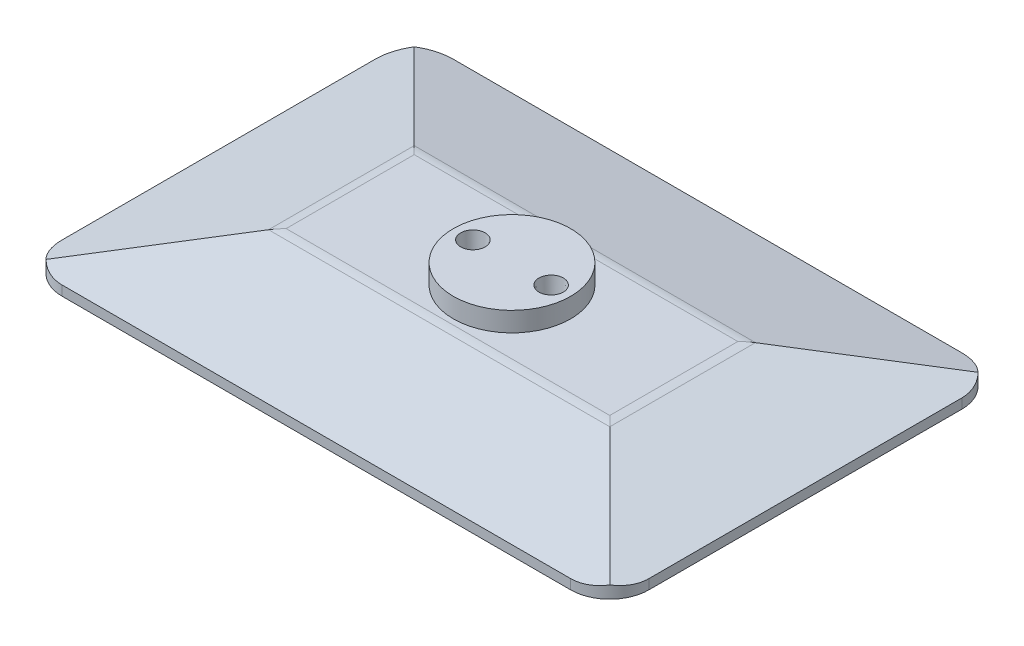
ISO-10303-21;
HEADER;
FILE_DESCRIPTION(('STEP AP214'),'2;1');
FILE_NAME('part.step','',(''),(''),'','','');
FILE_SCHEMA(('AUTOMOTIVE_DESIGN { 1 0 10303 214 1 1 1 1 }'));
ENDSEC;
DATA;
#1=APPLICATION_CONTEXT('core data for automotive mechanical design processes');
#2=APPLICATION_PROTOCOL_DEFINITION('international standard','automotive_design',2000,#1);
#3=PRODUCT_CONTEXT('',#1,'mechanical');
#4=PRODUCT('Part','Part','',(#3));
#5=PRODUCT_RELATED_PRODUCT_CATEGORY('part','',(#4));
#6=PRODUCT_DEFINITION_FORMATION('','',#4);
#7=PRODUCT_DEFINITION_CONTEXT('part definition',#1,'design');
#8=PRODUCT_DEFINITION('design','',#6,#7);
#9=PRODUCT_DEFINITION_SHAPE('','',#8);
#10=(LENGTH_UNIT() NAMED_UNIT(*) SI_UNIT(.MILLI.,.METRE.));
#11=(NAMED_UNIT(*) PLANE_ANGLE_UNIT() SI_UNIT($,.RADIAN.));
#12=(NAMED_UNIT(*) SI_UNIT($,.STERADIAN.) SOLID_ANGLE_UNIT());
#13=UNCERTAINTY_MEASURE_WITH_UNIT(LENGTH_MEASURE(1.E-05),#10,'distance_accuracy_value','');
#14=(GEOMETRIC_REPRESENTATION_CONTEXT(3) GLOBAL_UNCERTAINTY_ASSIGNED_CONTEXT((#13)) GLOBAL_UNIT_ASSIGNED_CONTEXT((#10,
#11,#12)) REPRESENTATION_CONTEXT('',''));
#15=CARTESIAN_POINT('',(0.,0.,0.));
#16=DIRECTION('',(0.,0.,1.));
#17=DIRECTION('',(1.,0.,0.));
#18=AXIS2_PLACEMENT_3D('',#15,#16,#17);
#19=CARTESIAN_POINT('',(35.9753753515998,1.,-9.78625051835227));
#20=DIRECTION('',(-1.,0.,0.));
#21=DIRECTION('',(0.,0.,1.));
#22=AXIS2_PLACEMENT_3D('',#19,#20,#21);
#23=PLANE('',#22);
#24=DIRECTION('',(0.,0.,-1.));
#25=VECTOR('',#24,1.);
#26=CARTESIAN_POINT('',(35.9753753515998,0.,-9.78625051835227));
#27=LINE('',#26,#25);
#28=CARTESIAN_POINT('',(35.9753753515998,0.,26.2137494816477));
#29=VERTEX_POINT('',#28);
#30=CARTESIAN_POINT('',(35.9753753515998,0.,-5.78625051835227));
#31=VERTEX_POINT('',#30);
#32=EDGE_CURVE('E173',#29,#31,#27,.T.);
#33=ORIENTED_EDGE('',*,*,#32,.T.);
#34=DIRECTION('',(0.,-1.,0.));
#35=VECTOR('',#34,1.);
#36=CARTESIAN_POINT('',(35.9753753515998,1.,-5.78625051835227));
#37=LINE('',#36,#35);
#38=CARTESIAN_POINT('',(35.9753753515998,1.,-5.78625051835227));
#39=VERTEX_POINT('',#38);
#40=EDGE_CURVE('E199',#31,#39,#37,.F.);
#41=ORIENTED_EDGE('',*,*,#40,.T.);
#42=DIRECTION('',(0.,0.,-1.));
#43=VECTOR('',#42,1.);
#44=CARTESIAN_POINT('',(35.9753753515998,1.,-9.78625051835227));
#45=LINE('',#44,#43);
#46=CARTESIAN_POINT('',(35.9753753515998,1.,26.2137494816477));
#47=VERTEX_POINT('',#46);
#48=EDGE_CURVE('E171',#47,#39,#45,.T.);
#49=ORIENTED_EDGE('',*,*,#48,.F.);
#50=DIRECTION('',(0.,-1.,0.));
#51=VECTOR('',#50,1.);
#52=CARTESIAN_POINT('',(35.9753753515998,1.,26.2137494816477));
#53=LINE('',#52,#51);
#54=EDGE_CURVE('E196',#47,#29,#53,.T.);
#55=ORIENTED_EDGE('',*,*,#54,.T.);
#56=EDGE_LOOP('',(#33,#41,#49,#55));
#57=FACE_BOUND('',#56,.T.);
#58=ADVANCED_FACE('F39',(#57),#23,.F.);
#59=CARTESIAN_POINT('',(-24.0246246484002,1.,-9.78625051835227));
#60=DIRECTION('',(0.,0.,1.));
#61=DIRECTION('',(1.,0.,0.));
#62=AXIS2_PLACEMENT_3D('',#59,#60,#61);
#63=PLANE('',#62);
#64=DIRECTION('',(-1.,0.,0.));
#65=VECTOR('',#64,1.);
#66=CARTESIAN_POINT('',(-24.0246246484002,0.,-9.78625051835227));
#67=LINE('',#66,#65);
#68=CARTESIAN_POINT('',(31.9753753515998,0.,-9.78625051835227));
#69=VERTEX_POINT('',#68);
#70=CARTESIAN_POINT('',(-20.0246246484002,0.,-9.78625051835227));
#71=VERTEX_POINT('',#70);
#72=EDGE_CURVE('E168',#69,#71,#67,.T.);
#73=ORIENTED_EDGE('',*,*,#72,.T.);
#74=DIRECTION('',(0.,-1.,0.));
#75=VECTOR('',#74,1.);
#76=CARTESIAN_POINT('',(-20.0246246484002,1.,-9.78625051835227));
#77=LINE('',#76,#75);
#78=CARTESIAN_POINT('',(-20.0246246484002,1.,-9.78625051835227));
#79=VERTEX_POINT('',#78);
#80=EDGE_CURVE('E146',#71,#79,#77,.F.);
#81=ORIENTED_EDGE('',*,*,#80,.T.);
#82=DIRECTION('',(-1.,0.,0.));
#83=VECTOR('',#82,1.);
#84=CARTESIAN_POINT('',(-24.0246246484002,1.,-9.78625051835227));
#85=LINE('',#84,#83);
#86=CARTESIAN_POINT('',(31.9753753515998,1.,-9.78625051835227));
#87=VERTEX_POINT('',#86);
#88=EDGE_CURVE('E267',#87,#79,#85,.T.);
#89=ORIENTED_EDGE('',*,*,#88,.F.);
#90=DIRECTION('',(0.,-1.,0.));
#91=VECTOR('',#90,1.);
#92=CARTESIAN_POINT('',(31.9753753515998,1.,-9.78625051835227));
#93=LINE('',#92,#91);
#94=EDGE_CURVE('E151',#87,#69,#93,.T.);
#95=ORIENTED_EDGE('',*,*,#94,.T.);
#96=EDGE_LOOP('',(#73,#81,#89,#95));
#97=FACE_BOUND('',#96,.T.);
#98=ADVANCED_FACE('F305',(#97),#63,.F.);
#99=CARTESIAN_POINT('',(-24.0246246484002,1.,-9.78625051835227));
#100=DIRECTION('',(1.,0.,0.));
#101=DIRECTION('',(0.,0.,-1.));
#102=AXIS2_PLACEMENT_3D('',#99,#100,#101);
#103=PLANE('',#102);
#104=DIRECTION('',(0.,0.,1.));
#105=VECTOR('',#104,1.);
#106=CARTESIAN_POINT('',(-24.0246246484002,1.,-9.78625051835227));
#107=LINE('',#106,#105);
#108=CARTESIAN_POINT('',(-24.0246246484002,1.,-5.78625051835227));
#109=VERTEX_POINT('',#108);
#110=CARTESIAN_POINT('',(-24.0246246484002,1.,26.2137494816477));
#111=VERTEX_POINT('',#110);
#112=EDGE_CURVE('E161',#109,#111,#107,.T.);
#113=ORIENTED_EDGE('',*,*,#112,.F.);
#114=DIRECTION('',(0.,-1.,0.));
#115=VECTOR('',#114,1.);
#116=CARTESIAN_POINT('',(-24.0246246484002,1.,-5.78625051835227));
#117=LINE('',#116,#115);
#118=CARTESIAN_POINT('',(-24.0246246484002,0.,-5.78625051835227));
#119=VERTEX_POINT('',#118);
#120=EDGE_CURVE('E145',#109,#119,#117,.T.);
#121=ORIENTED_EDGE('',*,*,#120,.T.);
#122=DIRECTION('',(0.,0.,1.));
#123=VECTOR('',#122,1.);
#124=CARTESIAN_POINT('',(-24.0246246484002,0.,-9.78625051835227));
#125=LINE('',#124,#123);
#126=CARTESIAN_POINT('',(-24.0246246484002,0.,26.2137494816477));
#127=VERTEX_POINT('',#126);
#128=EDGE_CURVE('E158',#119,#127,#125,.T.);
#129=ORIENTED_EDGE('',*,*,#128,.T.);
#130=DIRECTION('',(0.,-1.,0.));
#131=VECTOR('',#130,1.);
#132=CARTESIAN_POINT('',(-24.0246246484002,1.,26.2137494816477));
#133=LINE('',#132,#131);
#134=EDGE_CURVE('E163',#127,#111,#133,.F.);
#135=ORIENTED_EDGE('',*,*,#134,.T.);
#136=EDGE_LOOP('',(#113,#121,#129,#135));
#137=FACE_BOUND('',#136,.T.);
#138=ADVANCED_FACE('F157',(#137),#103,.F.);
#139=CARTESIAN_POINT('',(-24.0246246484002,1.,30.2137494816477));
#140=DIRECTION('',(0.,0.,-1.));
#141=DIRECTION('',(-1.,0.,0.));
#142=AXIS2_PLACEMENT_3D('',#139,#140,#141);
#143=PLANE('',#142);
#144=DIRECTION('',(1.,0.,0.));
#145=VECTOR('',#144,1.);
#146=CARTESIAN_POINT('',(-24.0246246484002,0.,30.2137494816477));
#147=LINE('',#146,#145);
#148=CARTESIAN_POINT('',(-20.0246246484002,0.,30.2137494816477));
#149=VERTEX_POINT('',#148);
#150=CARTESIAN_POINT('',(31.9753753515998,0.,30.2137494816477));
#151=VERTEX_POINT('',#150);
#152=EDGE_CURVE('E167',#149,#151,#147,.T.);
#153=ORIENTED_EDGE('',*,*,#152,.T.);
#154=DIRECTION('',(0.,-1.,0.));
#155=VECTOR('',#154,1.);
#156=CARTESIAN_POINT('',(31.9753753515998,1.,30.2137494816477));
#157=LINE('',#156,#155);
#158=CARTESIAN_POINT('',(31.9753753515998,1.,30.2137494816477));
#159=VERTEX_POINT('',#158);
#160=EDGE_CURVE('E209',#151,#159,#157,.F.);
#161=ORIENTED_EDGE('',*,*,#160,.T.);
#162=DIRECTION('',(1.,0.,0.));
#163=VECTOR('',#162,1.);
#164=CARTESIAN_POINT('',(-24.0246246484002,1.,30.2137494816477));
#165=LINE('',#164,#163);
#166=CARTESIAN_POINT('',(-20.0246246484002,1.,30.2137494816477));
#167=VERTEX_POINT('',#166);
#168=EDGE_CURVE('E177',#167,#159,#165,.T.);
#169=ORIENTED_EDGE('',*,*,#168,.F.);
#170=DIRECTION('',(0.,-1.,0.));
#171=VECTOR('',#170,1.);
#172=CARTESIAN_POINT('',(-20.0246246484002,1.,30.2137494816477));
#173=LINE('',#172,#171);
#174=EDGE_CURVE('E206',#167,#149,#173,.T.);
#175=ORIENTED_EDGE('',*,*,#174,.T.);
#176=EDGE_LOOP('',(#153,#161,#169,#175));
#177=FACE_BOUND('',#176,.T.);
#178=ADVANCED_FACE('F293',(#177),#143,.F.);
#179=CARTESIAN_POINT('',(0.,0.,0.));
#180=DIRECTION('',(0.,1.,0.));
#181=DIRECTION('',(0.,0.,1.));
#182=AXIS2_PLACEMENT_3D('',#179,#180,#181);
#183=PLANE('',#182);
#184=ORIENTED_EDGE('',*,*,#128,.F.);
#185=CARTESIAN_POINT('',(-20.0246246484002,0.,-5.78625051835227));
#186=DIRECTION('',(0.,1.,0.));
#187=DIRECTION('',(0.,0.,1.));
#188=AXIS2_PLACEMENT_3D('',#185,#186,#187);
#189=CIRCLE('',#188,4.);
#190=EDGE_CURVE('E140',#119,#71,#189,.F.);
#191=ORIENTED_EDGE('',*,*,#190,.T.);
#192=ORIENTED_EDGE('',*,*,#72,.F.);
#193=CARTESIAN_POINT('',(31.9753753515998,0.,-5.78625051835227));
#194=DIRECTION('',(0.,1.,0.));
#195=DIRECTION('',(0.,0.,1.));
#196=AXIS2_PLACEMENT_3D('',#193,#194,#195);
#197=CIRCLE('',#196,4.);
#198=EDGE_CURVE('E152',#69,#31,#197,.F.);
#199=ORIENTED_EDGE('',*,*,#198,.T.);
#200=ORIENTED_EDGE('',*,*,#32,.F.);
#201=CARTESIAN_POINT('',(31.9753753515998,0.,26.2137494816477));
#202=DIRECTION('',(0.,1.,0.));
#203=DIRECTION('',(0.,0.,1.));
#204=AXIS2_PLACEMENT_3D('',#201,#202,#203);
#205=CIRCLE('',#204,4.);
#206=EDGE_CURVE('E180',#29,#151,#205,.F.);
#207=ORIENTED_EDGE('',*,*,#206,.T.);
#208=ORIENTED_EDGE('',*,*,#152,.F.);
#209=CARTESIAN_POINT('',(-20.0246246484002,0.,26.2137494816477));
#210=DIRECTION('',(0.,1.,0.));
#211=DIRECTION('',(0.,0.,1.));
#212=AXIS2_PLACEMENT_3D('',#209,#210,#211);
#213=CIRCLE('',#212,4.);
#214=EDGE_CURVE('E162',#149,#127,#213,.F.);
#215=ORIENTED_EDGE('',*,*,#214,.T.);
#216=EDGE_LOOP('',(#184,#191,#192,#199,#200,#207,#208,#215));
#217=FACE_BOUND('',#216,.T.);
#218=ADVANCED_FACE('F165',(#217),#183,.F.);
#219=CARTESIAN_POINT('',(-24.0246246484002,1.,30.2137494816477));
#220=DIRECTION('',(0.,0.974370064785236,0.224951054343863));
#221=DIRECTION('',(0.,-0.224951054343863,0.974370064785236));
#222=AXIS2_PLACEMENT_3D('',#219,#220,#221);
#223=PLANE('',#222);
#224=DIRECTION('',(0.697868801664496,-0.161115707883246,0.697868801664496));
#225=VECTOR('',#224,1.);
#226=CARTESIAN_POINT('',(35.9753753515998,1.,30.2137494816477));
#227=LINE('',#226,#225);
#228=CARTESIAN_POINT('',(23.4250095129161,3.89748025914094,17.663383642964));
#229=VERTEX_POINT('',#228);
#230=CARTESIAN_POINT('',(34.803802476346,1.27047891048162,29.0421766063939));
#231=VERTEX_POINT('',#230);
#232=EDGE_CURVE('E260',#229,#231,#227,.T.);
#233=ORIENTED_EDGE('',*,*,#232,.F.);
#234=DIRECTION('',(1.,0.,0.));
#235=VECTOR('',#234,1.);
#236=CARTESIAN_POINT('',(-11.0301970255476,3.89748025914094,17.663383642964));
#237=LINE('',#236,#235);
#238=CARTESIAN_POINT('',(-11.4742588097165,3.89748025914094,17.663383642964));
#239=VERTEX_POINT('',#238);
#240=EDGE_CURVE('E11',#229,#239,#237,.F.);
#241=ORIENTED_EDGE('',*,*,#240,.T.);
#242=DIRECTION('',(-0.697868801664496,-0.161115707883246,0.697868801664496));
#243=VECTOR('',#242,1.);
#244=CARTESIAN_POINT('',(-24.0246246484002,1.,30.2137494816477));
#245=LINE('',#244,#243);
#246=CARTESIAN_POINT('',(-22.8530517731464,1.27047891048162,29.0421766063939));
#247=VERTEX_POINT('',#246);
#248=EDGE_CURVE('E248',#239,#247,#245,.T.);
#249=ORIENTED_EDGE('',*,*,#248,.T.);
#250=CARTESIAN_POINT('',(-20.0246246484002,1.92347276450225,26.2137494816477));
#251=DIRECTION('',(0.,0.974370064785236,0.224951054343863));
#252=DIRECTION('',(0.,-0.224951054343864,0.974370064785236));
#253=AXIS2_PLACEMENT_3D('',#250,#251,#252);
#254=ELLIPSE('',#253,4.10521643117356,4.);
#255=EDGE_CURVE('E211',#247,#167,#254,.T.);
#256=ORIENTED_EDGE('',*,*,#255,.T.);
#257=ORIENTED_EDGE('',*,*,#168,.T.);
#258=CARTESIAN_POINT('',(31.9753753515998,1.92347276450225,26.2137494816477));
#259=DIRECTION('',(0.,0.974370064785236,0.224951054343863));
#260=DIRECTION('',(0.,-0.224951054343864,0.974370064785236));
#261=AXIS2_PLACEMENT_3D('',#258,#259,#260);
#262=ELLIPSE('',#261,4.10521643117356,4.);
#263=EDGE_CURVE('E213',#159,#231,#262,.T.);
#264=ORIENTED_EDGE('',*,*,#263,.T.);
#265=EDGE_LOOP('',(#233,#241,#249,#256,#257,#264));
#266=FACE_BOUND('',#265,.T.);
#267=ADVANCED_FACE('F349',(#266),#223,.T.);
#268=CARTESIAN_POINT('',(35.9753753515998,1.,30.2137494816477));
#269=DIRECTION('',(0.224951054343863,0.974370064785236,0.));
#270=DIRECTION('',(-0.974370064785236,0.224951054343863,0.));
#271=AXIS2_PLACEMENT_3D('',#268,#269,#270);
#272=PLANE('',#271);
#273=DIRECTION('',(0.697868801664496,-0.161115707883246,-0.697868801664496));
#274=VECTOR('',#273,1.);
#275=CARTESIAN_POINT('',(35.9753753515998,1.,-9.78625051835227));
#276=LINE('',#275,#274);
#277=CARTESIAN_POINT('',(23.4250095129161,3.89748025914094,2.76411532033141));
#278=VERTEX_POINT('',#277);
#279=CARTESIAN_POINT('',(34.803802476346,1.27047891048162,-8.61467764309846));
#280=VERTEX_POINT('',#279);
#281=EDGE_CURVE('E261',#278,#280,#276,.T.);
#282=ORIENTED_EDGE('',*,*,#281,.F.);
#283=DIRECTION('',(0.,0.,-1.));
#284=VECTOR('',#283,1.);
#285=CARTESIAN_POINT('',(23.4250095129161,3.89748025914094,17.2193218587952));
#286=LINE('',#285,#284);
#287=EDGE_CURVE('E226',#278,#229,#286,.F.);
#288=ORIENTED_EDGE('',*,*,#287,.T.);
#289=ORIENTED_EDGE('',*,*,#232,.T.);
#290=CARTESIAN_POINT('',(31.9753753515998,1.92347276450224,26.2137494816477));
#291=DIRECTION('',(0.224951054343863,0.974370064785236,0.));
#292=DIRECTION('',(0.974370064785236,-0.224951054343864,0.));
#293=AXIS2_PLACEMENT_3D('',#290,#291,#292);
#294=ELLIPSE('',#293,4.10521643117356,4.);
#295=EDGE_CURVE('E201',#231,#47,#294,.T.);
#296=ORIENTED_EDGE('',*,*,#295,.T.);
#297=ORIENTED_EDGE('',*,*,#48,.T.);
#298=CARTESIAN_POINT('',(31.9753753515998,1.92347276450225,-5.78625051835227));
#299=DIRECTION('',(0.224951054343863,0.974370064785236,0.));
#300=DIRECTION('',(0.974370064785236,-0.224951054343864,0.));
#301=AXIS2_PLACEMENT_3D('',#298,#299,#300);
#302=ELLIPSE('',#301,4.10521643117356,4.);
#303=EDGE_CURVE('E203',#39,#280,#302,.T.);
#304=ORIENTED_EDGE('',*,*,#303,.T.);
#305=EDGE_LOOP('',(#282,#288,#289,#296,#297,#304));
#306=FACE_BOUND('',#305,.T.);
#307=ADVANCED_FACE('F285',(#306),#272,.T.);
#308=CARTESIAN_POINT('',(35.9753753515998,1.,-9.78625051835227));
#309=DIRECTION('',(0.,0.974370064785236,-0.224951054343863));
#310=DIRECTION('',(0.,0.224951054343863,0.974370064785236));
#311=AXIS2_PLACEMENT_3D('',#308,#309,#310);
#312=PLANE('',#311);
#313=DIRECTION('',(-0.697868801664496,-0.161115707883246,-0.697868801664496));
#314=VECTOR('',#313,1.);
#315=CARTESIAN_POINT('',(-24.0246246484002,1.,-9.78625051835227));
#316=LINE('',#315,#314);
#317=CARTESIAN_POINT('',(-11.4742588097165,3.89748025914094,2.76411532033141));
#318=VERTEX_POINT('',#317);
#319=CARTESIAN_POINT('',(-22.8530517731464,1.27047891048162,-8.61467764309846));
#320=VERTEX_POINT('',#319);
#321=EDGE_CURVE('E252',#318,#320,#316,.T.);
#322=ORIENTED_EDGE('',*,*,#321,.F.);
#323=DIRECTION('',(-1.,0.,0.));
#324=VECTOR('',#323,1.);
#325=CARTESIAN_POINT('',(22.9809477287473,3.89748025914094,2.76411532033141));
#326=LINE('',#325,#324);
#327=EDGE_CURVE('E229',#318,#278,#326,.F.);
#328=ORIENTED_EDGE('',*,*,#327,.T.);
#329=ORIENTED_EDGE('',*,*,#281,.T.);
#330=CARTESIAN_POINT('',(31.9753753515998,1.92347276450225,-5.78625051835227));
#331=DIRECTION('',(0.,0.974370064785236,-0.224951054343863));
#332=DIRECTION('',(0.,-0.224951054343864,-0.974370064785236));
#333=AXIS2_PLACEMENT_3D('',#330,#331,#332);
#334=ELLIPSE('',#333,4.10521643117356,4.);
#335=EDGE_CURVE('E186',#280,#87,#334,.T.);
#336=ORIENTED_EDGE('',*,*,#335,.T.);
#337=ORIENTED_EDGE('',*,*,#88,.T.);
#338=CARTESIAN_POINT('',(-20.0246246484002,1.92347276450225,-5.78625051835227));
#339=DIRECTION('',(0.,0.974370064785236,-0.224951054343863));
#340=DIRECTION('',(0.,-0.224951054343864,-0.974370064785236));
#341=AXIS2_PLACEMENT_3D('',#338,#339,#340);
#342=ELLIPSE('',#341,4.10521643117356,4.);
#343=EDGE_CURVE('E188',#79,#320,#342,.T.);
#344=ORIENTED_EDGE('',*,*,#343,.T.);
#345=EDGE_LOOP('',(#322,#328,#329,#336,#337,#344));
#346=FACE_BOUND('',#345,.T.);
#347=ADVANCED_FACE('F302',(#346),#312,.T.);
#348=CARTESIAN_POINT('',(-24.0246246484002,1.,-9.78625051835227));
#349=DIRECTION('',(-0.224951054343863,0.974370064785236,0.));
#350=DIRECTION('',(-0.974370064785236,-0.224951054343863,0.));
#351=AXIS2_PLACEMENT_3D('',#348,#349,#350);
#352=PLANE('',#351);
#353=ORIENTED_EDGE('',*,*,#248,.F.);
#354=DIRECTION('',(0.,0.,1.));
#355=VECTOR('',#354,1.);
#356=CARTESIAN_POINT('',(-11.4742588097165,3.89748025914094,3.20817710450029));
#357=LINE('',#356,#355);
#358=EDGE_CURVE('E48',#239,#318,#357,.F.);
#359=ORIENTED_EDGE('',*,*,#358,.T.);
#360=ORIENTED_EDGE('',*,*,#321,.T.);
#361=CARTESIAN_POINT('',(-20.0246246484002,1.92347276450225,-5.78625051835227));
#362=DIRECTION('',(-0.224951054343863,0.974370064785236,0.));
#363=DIRECTION('',(-0.974370064785236,-0.224951054343864,0.));
#364=AXIS2_PLACEMENT_3D('',#361,#362,#363);
#365=ELLIPSE('',#364,4.10521643117356,4.);
#366=EDGE_CURVE('E194',#320,#109,#365,.T.);
#367=ORIENTED_EDGE('',*,*,#366,.T.);
#368=ORIENTED_EDGE('',*,*,#112,.T.);
#369=CARTESIAN_POINT('',(-20.0246246484002,1.92347276450225,26.2137494816477));
#370=DIRECTION('',(-0.224951054343863,0.974370064785236,0.));
#371=DIRECTION('',(-0.974370064785236,-0.224951054343864,0.));
#372=AXIS2_PLACEMENT_3D('',#369,#370,#371);
#373=ELLIPSE('',#372,4.10521643117356,4.);
#374=EDGE_CURVE('E191',#111,#247,#373,.T.);
#375=ORIENTED_EDGE('',*,*,#374,.T.);
#376=EDGE_LOOP('',(#353,#359,#360,#367,#368,#375));
#377=FACE_BOUND('',#376,.T.);
#378=ADVANCED_FACE('F300',(#377),#352,.T.);
#379=CARTESIAN_POINT('',(0.,4.,0.));
#380=DIRECTION('',(0.,1.,0.));
#381=DIRECTION('',(0.,0.,1.));
#382=AXIS2_PLACEMENT_3D('',#379,#380,#381);
#383=PLANE('',#382);
#384=DIRECTION('',(-1.,0.,0.));
#385=VECTOR('',#384,1.);
#386=CARTESIAN_POINT('',(22.9809477287473,4.,16.7635794255886));
#387=LINE('',#386,#385);
#388=CARTESIAN_POINT('',(-10.574454592341,4.,16.7635794255886));
#389=VERTEX_POINT('',#388);
#390=CARTESIAN_POINT('',(22.5252052955407,4.,16.7635794255886));
#391=VERTEX_POINT('',#390);
#392=EDGE_CURVE('E217',#389,#391,#387,.F.);
#393=ORIENTED_EDGE('',*,*,#392,.T.);
#394=DIRECTION('',(0.,0.,1.));
#395=VECTOR('',#394,1.);
#396=CARTESIAN_POINT('',(22.5252052955407,4.,3.20817710450029));
#397=LINE('',#396,#395);
#398=CARTESIAN_POINT('',(22.5252052955407,4.,3.66391953770687));
#399=VERTEX_POINT('',#398);
#400=EDGE_CURVE('E223',#391,#399,#397,.F.);
#401=ORIENTED_EDGE('',*,*,#400,.T.);
#402=DIRECTION('',(1.,0.,0.));
#403=VECTOR('',#402,1.);
#404=CARTESIAN_POINT('',(-11.0301970255476,4.,3.66391953770687));
#405=LINE('',#404,#403);
#406=CARTESIAN_POINT('',(-10.574454592341,4.,3.66391953770687));
#407=VERTEX_POINT('',#406);
#408=EDGE_CURVE('E221',#399,#407,#405,.F.);
#409=ORIENTED_EDGE('',*,*,#408,.T.);
#410=DIRECTION('',(0.,0.,-1.));
#411=VECTOR('',#410,1.);
#412=CARTESIAN_POINT('',(-10.574454592341,4.,17.2193218587952));
#413=LINE('',#412,#411);
#414=EDGE_CURVE('E219',#407,#389,#413,.F.);
#415=ORIENTED_EDGE('',*,*,#414,.T.);
#416=EDGE_LOOP('',(#393,#401,#409,#415));
#417=FACE_BOUND('',#416,.T.);
#418=CARTESIAN_POINT('',(5.97537535159995,4.,10.2137494816475));
#419=DIRECTION('',(0.,1.,0.));
#420=DIRECTION('',(0.,0.,1.));
#421=AXIS2_PLACEMENT_3D('',#418,#419,#420);
#422=CIRCLE('',#421,6.);
#423=CARTESIAN_POINT('',(5.97537535159995,4.,16.2137494816475));
#424=VERTEX_POINT('',#423);
#425=EDGE_CURVE('E216',#424,#424,#422,.T.);
#426=ORIENTED_EDGE('',*,*,#425,.F.);
#427=EDGE_LOOP('',(#426));
#428=FACE_BOUND('',#427,.T.);
#429=ADVANCED_FACE('F318',(#417,#428),#383,.T.);
#430=CARTESIAN_POINT('',(-20.0246246484002,1.,-5.78625051835227));
#431=DIRECTION('',(0.,-1.,0.));
#432=DIRECTION('',(0.,0.,-1.));
#433=AXIS2_PLACEMENT_3D('',#430,#431,#432);
#434=CYLINDRICAL_SURFACE('',#433,4.);
#435=ORIENTED_EDGE('',*,*,#343,.F.);
#436=ORIENTED_EDGE('',*,*,#80,.F.);
#437=ORIENTED_EDGE('',*,*,#190,.F.);
#438=ORIENTED_EDGE('',*,*,#120,.F.);
#439=ORIENTED_EDGE('',*,*,#366,.F.);
#440=EDGE_LOOP('',(#435,#436,#437,#438,#439));
#441=FACE_BOUND('',#440,.T.);
#442=ADVANCED_FACE('F143',(#441),#434,.T.);
#443=CARTESIAN_POINT('',(31.9753753515998,1.,-5.78625051835227));
#444=DIRECTION('',(0.,-1.,0.));
#445=DIRECTION('',(0.,0.,-1.));
#446=AXIS2_PLACEMENT_3D('',#443,#444,#445);
#447=CYLINDRICAL_SURFACE('',#446,4.);
#448=ORIENTED_EDGE('',*,*,#303,.F.);
#449=ORIENTED_EDGE('',*,*,#40,.F.);
#450=ORIENTED_EDGE('',*,*,#198,.F.);
#451=ORIENTED_EDGE('',*,*,#94,.F.);
#452=ORIENTED_EDGE('',*,*,#335,.F.);
#453=EDGE_LOOP('',(#448,#449,#450,#451,#452));
#454=FACE_BOUND('',#453,.T.);
#455=ADVANCED_FACE('F280',(#454),#447,.T.);
#456=CARTESIAN_POINT('',(31.9753753515998,1.,26.2137494816477));
#457=DIRECTION('',(0.,-1.,0.));
#458=DIRECTION('',(0.,0.,-1.));
#459=AXIS2_PLACEMENT_3D('',#456,#457,#458);
#460=CYLINDRICAL_SURFACE('',#459,4.);
#461=ORIENTED_EDGE('',*,*,#263,.F.);
#462=ORIENTED_EDGE('',*,*,#160,.F.);
#463=ORIENTED_EDGE('',*,*,#206,.F.);
#464=ORIENTED_EDGE('',*,*,#54,.F.);
#465=ORIENTED_EDGE('',*,*,#295,.F.);
#466=EDGE_LOOP('',(#461,#462,#463,#464,#465));
#467=FACE_BOUND('',#466,.T.);
#468=ADVANCED_FACE('F290',(#467),#460,.T.);
#469=CARTESIAN_POINT('',(-20.0246246484002,1.,26.2137494816477));
#470=DIRECTION('',(0.,-1.,0.));
#471=DIRECTION('',(0.,0.,-1.));
#472=AXIS2_PLACEMENT_3D('',#469,#470,#471);
#473=CYLINDRICAL_SURFACE('',#472,4.);
#474=ORIENTED_EDGE('',*,*,#374,.F.);
#475=ORIENTED_EDGE('',*,*,#134,.F.);
#476=ORIENTED_EDGE('',*,*,#214,.F.);
#477=ORIENTED_EDGE('',*,*,#174,.F.);
#478=ORIENTED_EDGE('',*,*,#255,.F.);
#479=EDGE_LOOP('',(#474,#475,#476,#477,#478));
#480=FACE_BOUND('',#479,.T.);
#481=ADVANCED_FACE('F299',(#480),#473,.T.);
#482=CARTESIAN_POINT('',(5.97537535159995,6.,10.2137494816475));
#483=DIRECTION('',(0.,-1.,0.));
#484=DIRECTION('',(0.,0.,-1.));
#485=AXIS2_PLACEMENT_3D('',#482,#483,#484);
#486=CYLINDRICAL_SURFACE('',#485,6.);
#487=CARTESIAN_POINT('',(5.97537535159995,6.,10.2137494816475));
#488=DIRECTION('',(0.,1.,0.));
#489=DIRECTION('',(0.,0.,1.));
#490=AXIS2_PLACEMENT_3D('',#487,#488,#489);
#491=CIRCLE('',#490,6.);
#492=CARTESIAN_POINT('',(5.97537535159995,6.,16.2137494816475));
#493=VERTEX_POINT('',#492);
#494=EDGE_CURVE('E243',#493,#493,#491,.T.);
#495=ORIENTED_EDGE('',*,*,#494,.F.);
#496=EDGE_LOOP('',(#495));
#497=FACE_BOUND('',#496,.T.);
#498=ORIENTED_EDGE('',*,*,#425,.T.);
#499=EDGE_LOOP('',(#498));
#500=FACE_BOUND('',#499,.T.);
#501=ADVANCED_FACE('F325',(#497,#500),#486,.T.);
#502=CARTESIAN_POINT('',(5.97537535159995,6.,10.2137494816475));
#503=DIRECTION('',(0.,1.,0.));
#504=DIRECTION('',(0.,0.,1.));
#505=AXIS2_PLACEMENT_3D('',#502,#503,#504);
#506=PLANE('',#505);
#507=CARTESIAN_POINT('',(1.97537535159999,6.,10.2137494816475));
#508=DIRECTION('',(0.,1.,0.));
#509=DIRECTION('',(0.,0.,1.));
#510=AXIS2_PLACEMENT_3D('',#507,#508,#509);
#511=CIRCLE('',#510,1.25);
#512=CARTESIAN_POINT('',(1.97537535159999,6.,11.4637494816475));
#513=VERTEX_POINT('',#512);
#514=EDGE_CURVE('E570',#513,#513,#511,.T.);
#515=ORIENTED_EDGE('',*,*,#514,.F.);
#516=EDGE_LOOP('',(#515));
#517=FACE_BOUND('',#516,.T.);
#518=CARTESIAN_POINT('',(9.97537535159999,6.,10.2137494816475));
#519=DIRECTION('',(0.,1.,0.));
#520=DIRECTION('',(0.,0.,1.));
#521=AXIS2_PLACEMENT_3D('',#518,#519,#520);
#522=CIRCLE('',#521,1.24999999999979);
#523=CARTESIAN_POINT('',(9.97537535159999,6.,11.4637494816473));
#524=VERTEX_POINT('',#523);
#525=EDGE_CURVE('E256',#524,#524,#522,.T.);
#526=ORIENTED_EDGE('',*,*,#525,.F.);
#527=EDGE_LOOP('',(#526));
#528=FACE_BOUND('',#527,.T.);
#529=ORIENTED_EDGE('',*,*,#494,.T.);
#530=EDGE_LOOP('',(#529));
#531=FACE_BOUND('',#530,.T.);
#532=ADVANCED_FACE('F338',(#517,#528,#531),#506,.T.);
#533=CARTESIAN_POINT('',(-10.574454592341,0.,0.));
#534=DIRECTION('',(0.,0.,1.));
#535=DIRECTION('',(1.,0.,0.));
#536=AXIS2_PLACEMENT_3D('',#533,#534,#535);
#537=CYLINDRICAL_SURFACE('',#536,4.);
#538=CARTESIAN_POINT('',(-10.574454592341,0.,3.66391953770687));
#539=DIRECTION('',(-0.707106781186547,0.,0.707106781186547));
#540=DIRECTION('',(0.707106781186548,0.,0.707106781186547));
#541=AXIS2_PLACEMENT_3D('',#538,#539,#540);
#542=ELLIPSE('',#541,5.65685424949238,4.);
#543=EDGE_CURVE('E236',#318,#407,#542,.F.);
#544=ORIENTED_EDGE('',*,*,#543,.F.);
#545=ORIENTED_EDGE('',*,*,#358,.F.);
#546=CARTESIAN_POINT('',(-10.574454592341,0.,16.7635794255886));
#547=DIRECTION('',(0.707106781186548,0.,0.707106781186547));
#548=DIRECTION('',(0.707106781186547,0.,-0.707106781186547));
#549=AXIS2_PLACEMENT_3D('',#546,#547,#548);
#550=ELLIPSE('',#549,5.65685424949238,4.);
#551=EDGE_CURVE('E43',#389,#239,#550,.T.);
#552=ORIENTED_EDGE('',*,*,#551,.F.);
#553=ORIENTED_EDGE('',*,*,#414,.F.);
#554=EDGE_LOOP('',(#544,#545,#552,#553));
#555=FACE_BOUND('',#554,.T.);
#556=ADVANCED_FACE('F41',(#555),#537,.T.);
#557=CARTESIAN_POINT('',(0.,0.,16.7635794255886));
#558=DIRECTION('',(1.,0.,0.));
#559=DIRECTION('',(0.,0.,-1.));
#560=AXIS2_PLACEMENT_3D('',#557,#558,#559);
#561=CYLINDRICAL_SURFACE('',#560,4.);
#562=ORIENTED_EDGE('',*,*,#551,.T.);
#563=ORIENTED_EDGE('',*,*,#240,.F.);
#564=CARTESIAN_POINT('',(22.5252052955407,0.,16.7635794255886));
#565=DIRECTION('',(0.707106781186547,0.,-0.707106781186548));
#566=DIRECTION('',(0.707106781186548,0.,0.707106781186547));
#567=AXIS2_PLACEMENT_3D('',#564,#565,#566);
#568=ELLIPSE('',#567,5.65685424949238,4.);
#569=EDGE_CURVE('E234',#391,#229,#568,.T.);
#570=ORIENTED_EDGE('',*,*,#569,.F.);
#571=ORIENTED_EDGE('',*,*,#392,.F.);
#572=EDGE_LOOP('',(#562,#563,#570,#571));
#573=FACE_BOUND('',#572,.T.);
#574=ADVANCED_FACE('F333',(#573),#561,.T.);
#575=CARTESIAN_POINT('',(0.,0.,3.66391953770687));
#576=DIRECTION('',(-1.,0.,0.));
#577=DIRECTION('',(0.,0.,1.));
#578=AXIS2_PLACEMENT_3D('',#575,#576,#577);
#579=CYLINDRICAL_SURFACE('',#578,4.);
#580=ORIENTED_EDGE('',*,*,#543,.T.);
#581=ORIENTED_EDGE('',*,*,#408,.F.);
#582=CARTESIAN_POINT('',(22.5252052955407,0.,3.66391953770687));
#583=DIRECTION('',(-0.707106781186548,0.,-0.707106781186547));
#584=DIRECTION('',(-0.707106781186547,0.,0.707106781186548));
#585=AXIS2_PLACEMENT_3D('',#582,#583,#584);
#586=ELLIPSE('',#585,5.65685424949238,4.);
#587=EDGE_CURVE('E232',#278,#399,#586,.F.);
#588=ORIENTED_EDGE('',*,*,#587,.F.);
#589=ORIENTED_EDGE('',*,*,#327,.F.);
#590=EDGE_LOOP('',(#580,#581,#588,#589));
#591=FACE_BOUND('',#590,.T.);
#592=ADVANCED_FACE('F330',(#591),#579,.T.);
#593=CARTESIAN_POINT('',(22.5252052955407,0.,0.));
#594=DIRECTION('',(0.,0.,-1.));
#595=DIRECTION('',(-1.,0.,0.));
#596=AXIS2_PLACEMENT_3D('',#593,#594,#595);
#597=CYLINDRICAL_SURFACE('',#596,4.);
#598=ORIENTED_EDGE('',*,*,#569,.T.);
#599=ORIENTED_EDGE('',*,*,#287,.F.);
#600=ORIENTED_EDGE('',*,*,#587,.T.);
#601=ORIENTED_EDGE('',*,*,#400,.F.);
#602=EDGE_LOOP('',(#598,#599,#600,#601));
#603=FACE_BOUND('',#602,.T.);
#604=ADVANCED_FACE('F326',(#603),#597,.T.);
#605=CARTESIAN_POINT('',(9.97537535159999,6.,10.2137494816475));
#606=DIRECTION('',(0.,1.,0.));
#607=DIRECTION('',(0.,0.,1.));
#608=AXIS2_PLACEMENT_3D('',#605,#606,#607);
#609=CONICAL_SURFACE('',#608,1.24999999999979,0.0872664625997167);
#610=CARTESIAN_POINT('',(9.97537535159999,3.,10.2137494816475));
#611=DIRECTION('',(0.,1.,0.));
#612=DIRECTION('',(0.,0.,1.));
#613=AXIS2_PLACEMENT_3D('',#610,#611,#612);
#614=CIRCLE('',#613,0.987534009422022);
#615=CARTESIAN_POINT('',(9.97537535159999,3.,11.2012834910695));
#616=VERTEX_POINT('',#615);
#617=EDGE_CURVE('E574',#616,#616,#614,.T.);
#618=ORIENTED_EDGE('',*,*,#617,.F.);
#619=EDGE_LOOP('',(#618));
#620=FACE_BOUND('',#619,.T.);
#621=ORIENTED_EDGE('',*,*,#525,.T.);
#622=EDGE_LOOP('',(#621));
#623=FACE_BOUND('',#622,.T.);
#624=ADVANCED_FACE('F329',(#620,#623),#609,.F.);
#625=CARTESIAN_POINT('',(9.97537535159999,3.,10.2137494816475));
#626=DIRECTION('',(0.,1.,0.));
#627=DIRECTION('',(0.,0.,1.));
#628=AXIS2_PLACEMENT_3D('',#625,#626,#627);
#629=PLANE('',#628);
#630=ORIENTED_EDGE('',*,*,#617,.T.);
#631=EDGE_LOOP('',(#630));
#632=FACE_BOUND('',#631,.T.);
#633=ADVANCED_FACE('F486',(#632),#629,.T.);
#634=CARTESIAN_POINT('',(1.97537535159999,6.,10.2137494816475));
#635=DIRECTION('',(0.,1.,0.));
#636=DIRECTION('',(0.,0.,1.));
#637=AXIS2_PLACEMENT_3D('',#634,#635,#636);
#638=CONICAL_SURFACE('',#637,1.25,0.0872664625997167);
#639=CARTESIAN_POINT('',(1.97537535159999,3.,10.2137494816475));
#640=DIRECTION('',(0.,1.,0.));
#641=DIRECTION('',(0.,0.,1.));
#642=AXIS2_PLACEMENT_3D('',#639,#640,#641);
#643=CIRCLE('',#642,0.987534009422227);
#644=CARTESIAN_POINT('',(1.97537535159999,3.,11.2012834910697));
#645=VERTEX_POINT('',#644);
#646=EDGE_CURVE('E235',#645,#645,#643,.T.);
#647=ORIENTED_EDGE('',*,*,#646,.F.);
#648=EDGE_LOOP('',(#647));
#649=FACE_BOUND('',#648,.T.);
#650=ORIENTED_EDGE('',*,*,#514,.T.);
#651=EDGE_LOOP('',(#650));
#652=FACE_BOUND('',#651,.T.);
#653=ADVANCED_FACE('F497',(#649,#652),#638,.F.);
#654=CARTESIAN_POINT('',(1.97537535159999,3.,10.2137494816475));
#655=DIRECTION('',(0.,1.,0.));
#656=DIRECTION('',(0.,0.,1.));
#657=AXIS2_PLACEMENT_3D('',#654,#655,#656);
#658=PLANE('',#657);
#659=ORIENTED_EDGE('',*,*,#646,.T.);
#660=EDGE_LOOP('',(#659));
#661=FACE_BOUND('',#660,.T.);
#662=ADVANCED_FACE('F508',(#661),#658,.T.);
#663=CLOSED_SHELL('',(#58,#98,#138,#178,#218,#267,#307,#347,#378,#429,#442,#455,#468,#481,#501,
#532,#556,#574,#592,#604,#624,#633,#653,#662));
#664=MANIFOLD_SOLID_BREP('B2',#663);
#665=ADVANCED_BREP_SHAPE_REPRESENTATION('',(#18,#664),#14);
#666=SHAPE_DEFINITION_REPRESENTATION(#9,#665);
ENDSEC;
END-ISO-10303-21;
